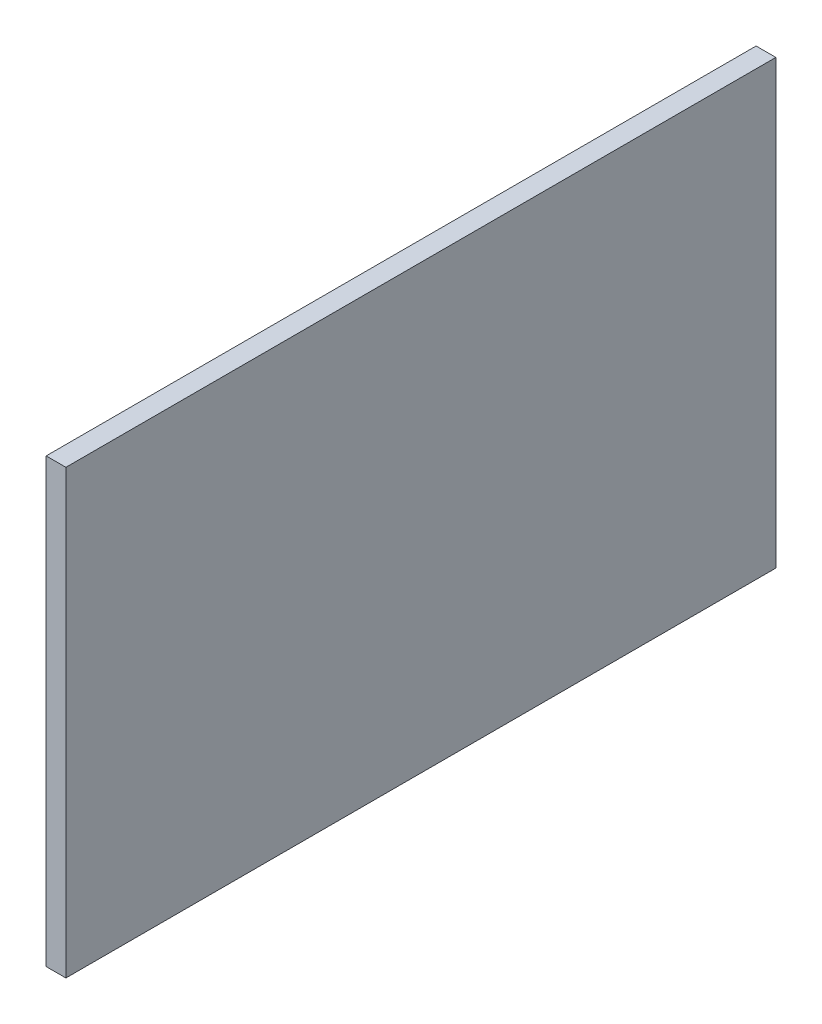
ISO-10303-21;
HEADER;
FILE_DESCRIPTION(('STEP AP214'),'2;1');
FILE_NAME('part.step','',(''),(''),'','','');
FILE_SCHEMA(('AUTOMOTIVE_DESIGN { 1 0 10303 214 1 1 1 1 }'));
ENDSEC;
DATA;
#1=APPLICATION_CONTEXT('core data for automotive mechanical design processes');
#2=APPLICATION_PROTOCOL_DEFINITION('international standard','automotive_design',2000,#1);
#3=PRODUCT_CONTEXT('',#1,'mechanical');
#4=PRODUCT('Part','Part','',(#3));
#5=PRODUCT_RELATED_PRODUCT_CATEGORY('part','',(#4));
#6=PRODUCT_DEFINITION_FORMATION('','',#4);
#7=PRODUCT_DEFINITION_CONTEXT('part definition',#1,'design');
#8=PRODUCT_DEFINITION('design','',#6,#7);
#9=PRODUCT_DEFINITION_SHAPE('','',#8);
#10=(LENGTH_UNIT() NAMED_UNIT(*) SI_UNIT(.MILLI.,.METRE.));
#11=(NAMED_UNIT(*) PLANE_ANGLE_UNIT() SI_UNIT($,.RADIAN.));
#12=(NAMED_UNIT(*) SI_UNIT($,.STERADIAN.) SOLID_ANGLE_UNIT());
#13=UNCERTAINTY_MEASURE_WITH_UNIT(LENGTH_MEASURE(1.E-05),#10,'distance_accuracy_value','');
#14=(GEOMETRIC_REPRESENTATION_CONTEXT(3) GLOBAL_UNCERTAINTY_ASSIGNED_CONTEXT((#13)) GLOBAL_UNIT_ASSIGNED_CONTEXT((#10,
#11,#12)) REPRESENTATION_CONTEXT('',''));
#15=CARTESIAN_POINT('',(0.,0.,0.));
#16=DIRECTION('',(0.,0.,1.));
#17=DIRECTION('',(1.,0.,0.));
#18=AXIS2_PLACEMENT_3D('',#15,#16,#17);
#19=CARTESIAN_POINT('',(22.225,177.8,36.3386468829509));
#20=DIRECTION('',(0.,1.,0.));
#21=DIRECTION('',(1.,0.,0.));
#22=AXIS2_PLACEMENT_3D('',#19,#20,#21);
#23=PLANE('',#22);
#24=DIRECTION('',(0.,0.,-1.));
#25=VECTOR('',#24,1.);
#26=CARTESIAN_POINT('',(25.4,177.8,28.4011468829509));
#27=LINE('',#26,#25);
#28=CARTESIAN_POINT('',(25.4,177.8,158.402293765902));
#29=VERTEX_POINT('',#28);
#30=CARTESIAN_POINT('',(25.4,177.8,-127.));
#31=VERTEX_POINT('',#30);
#32=EDGE_CURVE('E51',#29,#31,#27,.T.);
#33=ORIENTED_EDGE('',*,*,#32,.F.);
#34=DIRECTION('',(-1.,0.,0.));
#35=VECTOR('',#34,1.);
#36=CARTESIAN_POINT('',(33.3375,177.8,158.402293765902));
#37=LINE('',#36,#35);
#38=CARTESIAN_POINT('',(33.3375,177.8,158.402293765902));
#39=VERTEX_POINT('',#38);
#40=EDGE_CURVE('E109',#39,#29,#37,.T.);
#41=ORIENTED_EDGE('',*,*,#40,.F.);
#42=DIRECTION('',(0.,0.,-1.));
#43=VECTOR('',#42,1.);
#44=CARTESIAN_POINT('',(33.3375,177.8,28.4011468829509));
#45=LINE('',#44,#43);
#46=CARTESIAN_POINT('',(33.3375,177.8,-127.));
#47=VERTEX_POINT('',#46);
#48=EDGE_CURVE('E12',#39,#47,#45,.T.);
#49=ORIENTED_EDGE('',*,*,#48,.T.);
#50=DIRECTION('',(1.,0.,0.));
#51=VECTOR('',#50,1.);
#52=CARTESIAN_POINT('',(25.4,177.8,-127.));
#53=LINE('',#52,#51);
#54=EDGE_CURVE('E97',#31,#47,#53,.T.);
#55=ORIENTED_EDGE('',*,*,#54,.F.);
#56=EDGE_LOOP('',(#33,#41,#49,#55));
#57=FACE_BOUND('',#56,.T.);
#58=ADVANCED_FACE('F41',(#57),#23,.T.);
#59=CARTESIAN_POINT('',(22.225,0.,-4.93635311704913));
#60=DIRECTION('',(0.,-1.,0.));
#61=DIRECTION('',(-1.,0.,0.));
#62=AXIS2_PLACEMENT_3D('',#59,#60,#61);
#63=PLANE('',#62);
#64=DIRECTION('',(0.,0.,-1.));
#65=VECTOR('',#64,1.);
#66=CARTESIAN_POINT('',(25.4,0.,28.4011468829509));
#67=LINE('',#66,#65);
#68=CARTESIAN_POINT('',(25.4,0.,158.402293765902));
#69=VERTEX_POINT('',#68);
#70=CARTESIAN_POINT('',(25.4,0.,-127.));
#71=VERTEX_POINT('',#70);
#72=EDGE_CURVE('E72',#69,#71,#67,.T.);
#73=ORIENTED_EDGE('',*,*,#72,.T.);
#74=DIRECTION('',(1.,0.,0.));
#75=VECTOR('',#74,1.);
#76=CARTESIAN_POINT('',(25.4,0.,-127.));
#77=LINE('',#76,#75);
#78=CARTESIAN_POINT('',(33.3375,0.,-127.));
#79=VERTEX_POINT('',#78);
#80=EDGE_CURVE('E98',#71,#79,#77,.T.);
#81=ORIENTED_EDGE('',*,*,#80,.T.);
#82=DIRECTION('',(0.,0.,-1.));
#83=VECTOR('',#82,1.);
#84=CARTESIAN_POINT('',(33.3375,0.,28.4011468829509));
#85=LINE('',#84,#83);
#86=CARTESIAN_POINT('',(33.3375,0.,158.402293765902));
#87=VERTEX_POINT('',#86);
#88=EDGE_CURVE('E45',#87,#79,#85,.T.);
#89=ORIENTED_EDGE('',*,*,#88,.F.);
#90=DIRECTION('',(-1.,0.,0.));
#91=VECTOR('',#90,1.);
#92=CARTESIAN_POINT('',(33.3375,0.,158.402293765902));
#93=LINE('',#92,#91);
#94=EDGE_CURVE('E106',#87,#69,#93,.T.);
#95=ORIENTED_EDGE('',*,*,#94,.T.);
#96=EDGE_LOOP('',(#73,#81,#89,#95));
#97=FACE_BOUND('',#96,.T.);
#98=ADVANCED_FACE('F110',(#97),#63,.T.);
#99=CARTESIAN_POINT('',(25.4,177.8,0.));
#100=DIRECTION('',(-1.,0.,0.));
#101=DIRECTION('',(0.,0.,1.));
#102=AXIS2_PLACEMENT_3D('',#99,#100,#101);
#103=PLANE('',#102);
#104=ORIENTED_EDGE('',*,*,#72,.F.);
#105=DIRECTION('',(0.,-1.,0.));
#106=VECTOR('',#105,1.);
#107=CARTESIAN_POINT('',(25.4,177.8,158.402293765902));
#108=LINE('',#107,#106);
#109=EDGE_CURVE('E91',#29,#69,#108,.T.);
#110=ORIENTED_EDGE('',*,*,#109,.F.);
#111=ORIENTED_EDGE('',*,*,#32,.T.);
#112=DIRECTION('',(0.,-1.,0.));
#113=VECTOR('',#112,1.);
#114=CARTESIAN_POINT('',(25.4,177.8,-127.));
#115=LINE('',#114,#113);
#116=EDGE_CURVE('E89',#31,#71,#115,.T.);
#117=ORIENTED_EDGE('',*,*,#116,.T.);
#118=EDGE_LOOP('',(#104,#110,#111,#117));
#119=FACE_BOUND('',#118,.T.);
#120=ADVANCED_FACE('F43',(#119),#103,.T.);
#121=CARTESIAN_POINT('',(33.3375,177.8,28.4011468829509));
#122=DIRECTION('',(-1.,0.,0.));
#123=DIRECTION('',(0.,0.,1.));
#124=AXIS2_PLACEMENT_3D('',#121,#122,#123);
#125=PLANE('',#124);
#126=ORIENTED_EDGE('',*,*,#88,.T.);
#127=DIRECTION('',(0.,-1.,0.));
#128=VECTOR('',#127,1.);
#129=CARTESIAN_POINT('',(33.3375,177.8,-127.));
#130=LINE('',#129,#128);
#131=EDGE_CURVE('E99',#47,#79,#130,.T.);
#132=ORIENTED_EDGE('',*,*,#131,.F.);
#133=ORIENTED_EDGE('',*,*,#48,.F.);
#134=DIRECTION('',(0.,-1.,0.));
#135=VECTOR('',#134,1.);
#136=CARTESIAN_POINT('',(33.3375,177.8,158.402293765902));
#137=LINE('',#136,#135);
#138=EDGE_CURVE('E104',#39,#87,#137,.T.);
#139=ORIENTED_EDGE('',*,*,#138,.T.);
#140=EDGE_LOOP('',(#126,#132,#133,#139));
#141=FACE_BOUND('',#140,.T.);
#142=ADVANCED_FACE('F114',(#141),#125,.F.);
#143=CARTESIAN_POINT('',(33.3375,177.8,158.402293765902));
#144=DIRECTION('',(0.,0.,1.));
#145=DIRECTION('',(1.,0.,0.));
#146=AXIS2_PLACEMENT_3D('',#143,#144,#145);
#147=PLANE('',#146);
#148=ORIENTED_EDGE('',*,*,#94,.F.);
#149=ORIENTED_EDGE('',*,*,#138,.F.);
#150=ORIENTED_EDGE('',*,*,#40,.T.);
#151=ORIENTED_EDGE('',*,*,#109,.T.);
#152=EDGE_LOOP('',(#148,#149,#150,#151));
#153=FACE_BOUND('',#152,.T.);
#154=ADVANCED_FACE('F113',(#153),#147,.T.);
#155=CARTESIAN_POINT('',(25.4,177.8,-127.));
#156=DIRECTION('',(0.,0.,-1.));
#157=DIRECTION('',(-1.,0.,0.));
#158=AXIS2_PLACEMENT_3D('',#155,#156,#157);
#159=PLANE('',#158);
#160=ORIENTED_EDGE('',*,*,#80,.F.);
#161=ORIENTED_EDGE('',*,*,#116,.F.);
#162=ORIENTED_EDGE('',*,*,#54,.T.);
#163=ORIENTED_EDGE('',*,*,#131,.T.);
#164=EDGE_LOOP('',(#160,#161,#162,#163));
#165=FACE_BOUND('',#164,.T.);
#166=ADVANCED_FACE('F96',(#165),#159,.T.);
#167=CLOSED_SHELL('',(#58,#98,#120,#142,#154,#166));
#168=MANIFOLD_SOLID_BREP('B2',#167);
#169=ADVANCED_BREP_SHAPE_REPRESENTATION('',(#18,#168),#14);
#170=SHAPE_DEFINITION_REPRESENTATION(#9,#169);
ENDSEC;
END-ISO-10303-21;
